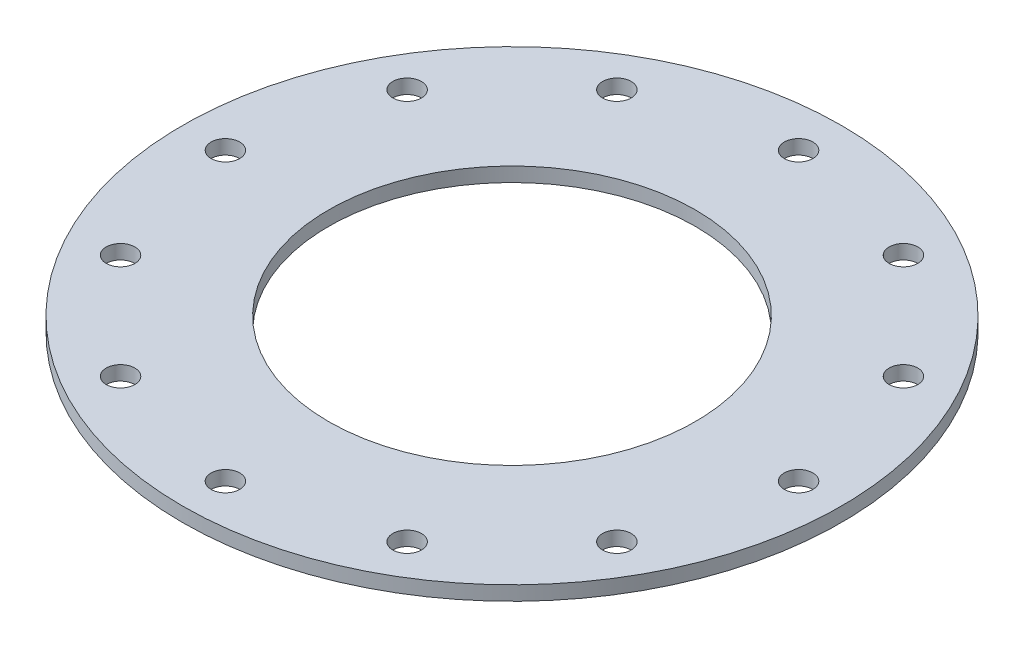
ISO-10303-21;
HEADER;
FILE_DESCRIPTION(('STEP AP214'),'2;1');
FILE_NAME('part.step','',(''),(''),'','','');
FILE_SCHEMA(('AUTOMOTIVE_DESIGN { 1 0 10303 214 1 1 1 1 }'));
ENDSEC;
DATA;
#1=APPLICATION_CONTEXT('core data for automotive mechanical design processes');
#2=APPLICATION_PROTOCOL_DEFINITION('international standard','automotive_design',2000,#1);
#3=PRODUCT_CONTEXT('',#1,'mechanical');
#4=PRODUCT('Part','Part','',(#3));
#5=PRODUCT_RELATED_PRODUCT_CATEGORY('part','',(#4));
#6=PRODUCT_DEFINITION_FORMATION('','',#4);
#7=PRODUCT_DEFINITION_CONTEXT('part definition',#1,'design');
#8=PRODUCT_DEFINITION('design','',#6,#7);
#9=PRODUCT_DEFINITION_SHAPE('','',#8);
#10=(LENGTH_UNIT() NAMED_UNIT(*) SI_UNIT(.MILLI.,.METRE.));
#11=(NAMED_UNIT(*) PLANE_ANGLE_UNIT() SI_UNIT($,.RADIAN.));
#12=(NAMED_UNIT(*) SI_UNIT($,.STERADIAN.) SOLID_ANGLE_UNIT());
#13=UNCERTAINTY_MEASURE_WITH_UNIT(LENGTH_MEASURE(1.E-05),#10,'distance_accuracy_value','');
#14=(GEOMETRIC_REPRESENTATION_CONTEXT(3) GLOBAL_UNCERTAINTY_ASSIGNED_CONTEXT((#13)) GLOBAL_UNIT_ASSIGNED_CONTEXT((#10,
#11,#12)) REPRESENTATION_CONTEXT('',''));
#15=CARTESIAN_POINT('',(0.,0.,0.));
#16=DIRECTION('',(0.,0.,1.));
#17=DIRECTION('',(1.,0.,0.));
#18=AXIS2_PLACEMENT_3D('',#15,#16,#17);
#19=CARTESIAN_POINT('',(0.,3.175,0.));
#20=DIRECTION('',(0.,-1.,0.));
#21=DIRECTION('',(0.,0.,-1.));
#22=AXIS2_PLACEMENT_3D('',#19,#20,#21);
#23=CYLINDRICAL_SURFACE('',#22,73.025);
#24=CARTESIAN_POINT('',(0.,3.175,0.));
#25=DIRECTION('',(0.,1.,0.));
#26=DIRECTION('',(0.,0.,1.));
#27=AXIS2_PLACEMENT_3D('',#24,#25,#26);
#28=CIRCLE('',#27,73.025);
#29=CARTESIAN_POINT('',(0.,3.175,73.025));
#30=VERTEX_POINT('',#29);
#31=EDGE_CURVE('E10',#30,#30,#28,.T.);
#32=ORIENTED_EDGE('',*,*,#31,.F.);
#33=EDGE_LOOP('',(#32));
#34=FACE_BOUND('',#33,.T.);
#35=CARTESIAN_POINT('',(0.,0.,0.));
#36=DIRECTION('',(0.,1.,0.));
#37=DIRECTION('',(0.,0.,1.));
#38=AXIS2_PLACEMENT_3D('',#35,#36,#37);
#39=CIRCLE('',#38,73.025);
#40=CARTESIAN_POINT('',(0.,0.,73.025));
#41=VERTEX_POINT('',#40);
#42=EDGE_CURVE('E39',#41,#41,#39,.T.);
#43=ORIENTED_EDGE('',*,*,#42,.T.);
#44=EDGE_LOOP('',(#43));
#45=FACE_BOUND('',#44,.T.);
#46=ADVANCED_FACE('F36',(#34,#45),#23,.T.);
#47=CARTESIAN_POINT('',(0.,3.175,0.));
#48=DIRECTION('',(0.,1.,0.));
#49=DIRECTION('',(0.,0.,1.));
#50=AXIS2_PLACEMENT_3D('',#47,#48,#49);
#51=PLANE('',#50);
#52=CARTESIAN_POINT('',(0.,3.175,0.));
#53=DIRECTION('',(0.,1.,0.));
#54=DIRECTION('',(0.,0.,1.));
#55=AXIS2_PLACEMENT_3D('',#52,#53,#54);
#56=CIRCLE('',#55,40.64);
#57=CARTESIAN_POINT('',(0.,3.175,40.64));
#58=VERTEX_POINT('',#57);
#59=EDGE_CURVE('E146',#58,#58,#56,.T.);
#60=ORIENTED_EDGE('',*,*,#59,.F.);
#61=EDGE_LOOP('',(#60));
#62=FACE_BOUND('',#61,.T.);
#63=CARTESIAN_POINT('',(63.5,3.175,0.));
#64=DIRECTION('',(0.,1.,0.));
#65=DIRECTION('',(0.,0.,1.));
#66=AXIS2_PLACEMENT_3D('',#63,#64,#65);
#67=CIRCLE('',#66,3.175);
#68=CARTESIAN_POINT('',(63.5,3.175,3.175));
#69=VERTEX_POINT('',#68);
#70=EDGE_CURVE('E83',#69,#69,#67,.T.);
#71=ORIENTED_EDGE('',*,*,#70,.F.);
#72=EDGE_LOOP('',(#71));
#73=FACE_BOUND('',#72,.T.);
#74=CARTESIAN_POINT('',(54.9926131403123,3.175,-31.7499999999993));
#75=DIRECTION('',(0.,1.,0.));
#76=DIRECTION('',(0.,0.,1.));
#77=AXIS2_PLACEMENT_3D('',#74,#75,#76);
#78=CIRCLE('',#77,3.17499999999999);
#79=CARTESIAN_POINT('',(54.9926131403123,3.175,-28.5749999999993));
#80=VERTEX_POINT('',#79);
#81=EDGE_CURVE('E116',#80,#80,#78,.T.);
#82=ORIENTED_EDGE('',*,*,#81,.F.);
#83=EDGE_LOOP('',(#82));
#84=FACE_BOUND('',#83,.T.);
#85=CARTESIAN_POINT('',(31.7500000000006,3.175,-54.9926131403115));
#86=DIRECTION('',(0.,1.,0.));
#87=DIRECTION('',(0.,0.,1.));
#88=AXIS2_PLACEMENT_3D('',#85,#86,#87);
#89=CIRCLE('',#88,3.175);
#90=CARTESIAN_POINT('',(31.7500000000006,3.175,-51.8176131403115));
#91=VERTEX_POINT('',#90);
#92=EDGE_CURVE('E125',#91,#91,#89,.T.);
#93=ORIENTED_EDGE('',*,*,#92,.F.);
#94=EDGE_LOOP('',(#93));
#95=FACE_BOUND('',#94,.T.);
#96=CARTESIAN_POINT('',(6.65127195049617E-13,3.175,-63.5));
#97=DIRECTION('',(0.,1.,0.));
#98=DIRECTION('',(0.,0.,1.));
#99=AXIS2_PLACEMENT_3D('',#96,#97,#98);
#100=CIRCLE('',#99,3.175);
#101=CARTESIAN_POINT('',(6.65127195049617E-13,3.175,-60.325));
#102=VERTEX_POINT('',#101);
#103=EDGE_CURVE('E133',#102,#102,#100,.T.);
#104=ORIENTED_EDGE('',*,*,#103,.F.);
#105=EDGE_LOOP('',(#104));
#106=FACE_BOUND('',#105,.T.);
#107=CARTESIAN_POINT('',(54.9926131403118,3.175,31.7500000000001));
#108=DIRECTION('',(0.,1.,0.));
#109=DIRECTION('',(0.,0.,1.));
#110=AXIS2_PLACEMENT_3D('',#107,#108,#109);
#111=CIRCLE('',#110,3.17499999999999);
#112=CARTESIAN_POINT('',(54.9926131403118,3.175,34.9250000000001));
#113=VERTEX_POINT('',#112);
#114=EDGE_CURVE('E75',#113,#113,#111,.T.);
#115=ORIENTED_EDGE('',*,*,#114,.F.);
#116=EDGE_LOOP('',(#115));
#117=FACE_BOUND('',#116,.T.);
#118=CARTESIAN_POINT('',(31.7499999999999,3.175,54.9926131403119));
#119=DIRECTION('',(0.,1.,0.));
#120=DIRECTION('',(0.,0.,1.));
#121=AXIS2_PLACEMENT_3D('',#118,#119,#120);
#122=CIRCLE('',#121,3.175);
#123=CARTESIAN_POINT('',(31.7499999999999,3.175,58.1676131403119));
#124=VERTEX_POINT('',#123);
#125=EDGE_CURVE('E67',#124,#124,#122,.T.);
#126=ORIENTED_EDGE('',*,*,#125,.F.);
#127=EDGE_LOOP('',(#126));
#128=FACE_BOUND('',#127,.T.);
#129=CARTESIAN_POINT('',(-2.21709065016539E-13,3.175,63.5));
#130=DIRECTION('',(0.,1.,0.));
#131=DIRECTION('',(0.,0.,1.));
#132=AXIS2_PLACEMENT_3D('',#129,#130,#131);
#133=CIRCLE('',#132,3.17499999999999);
#134=CARTESIAN_POINT('',(-2.21709065016539E-13,3.175,66.675));
#135=VERTEX_POINT('',#134);
#136=EDGE_CURVE('E59',#135,#135,#133,.T.);
#137=ORIENTED_EDGE('',*,*,#136,.F.);
#138=EDGE_LOOP('',(#137));
#139=FACE_BOUND('',#138,.T.);
#140=CARTESIAN_POINT('',(-31.7500000000003,3.175,54.9926131403117));
#141=DIRECTION('',(0.,1.,0.));
#142=DIRECTION('',(0.,0.,1.));
#143=AXIS2_PLACEMENT_3D('',#140,#141,#142);
#144=CIRCLE('',#143,3.175);
#145=CARTESIAN_POINT('',(-31.7500000000003,3.175,58.1676131403117));
#146=VERTEX_POINT('',#145);
#147=EDGE_CURVE('E50',#146,#146,#144,.T.);
#148=ORIENTED_EDGE('',*,*,#147,.F.);
#149=EDGE_LOOP('',(#148));
#150=FACE_BOUND('',#149,.T.);
#151=CARTESIAN_POINT('',(-54.9926131403121,3.175,31.7499999999997));
#152=DIRECTION('',(0.,1.,0.));
#153=DIRECTION('',(0.,0.,1.));
#154=AXIS2_PLACEMENT_3D('',#151,#152,#153);
#155=CIRCLE('',#154,3.175);
#156=CARTESIAN_POINT('',(-54.9926131403121,3.175,34.9249999999997));
#157=VERTEX_POINT('',#156);
#158=EDGE_CURVE('E109',#157,#157,#155,.T.);
#159=ORIENTED_EDGE('',*,*,#158,.F.);
#160=EDGE_LOOP('',(#159));
#161=FACE_BOUND('',#160,.T.);
#162=CARTESIAN_POINT('',(-63.5,3.175,-4.43418130033078E-13));
#163=DIRECTION('',(0.,1.,0.));
#164=DIRECTION('',(0.,0.,1.));
#165=AXIS2_PLACEMENT_3D('',#162,#163,#164);
#166=CIRCLE('',#165,3.17499999999999);
#167=CARTESIAN_POINT('',(-63.5,3.175,3.17499999999955));
#168=VERTEX_POINT('',#167);
#169=EDGE_CURVE('E101',#168,#168,#166,.T.);
#170=ORIENTED_EDGE('',*,*,#169,.F.);
#171=EDGE_LOOP('',(#170));
#172=FACE_BOUND('',#171,.T.);
#173=CARTESIAN_POINT('',(-54.9926131403116,3.175,-31.7500000000005));
#174=DIRECTION('',(0.,1.,0.));
#175=DIRECTION('',(0.,0.,1.));
#176=AXIS2_PLACEMENT_3D('',#173,#174,#175);
#177=CIRCLE('',#176,3.17499999999999);
#178=CARTESIAN_POINT('',(-54.9926131403116,3.175,-28.5750000000005));
#179=VERTEX_POINT('',#178);
#180=EDGE_CURVE('E93',#179,#179,#177,.T.);
#181=ORIENTED_EDGE('',*,*,#180,.F.);
#182=EDGE_LOOP('',(#181));
#183=FACE_BOUND('',#182,.T.);
#184=CARTESIAN_POINT('',(-31.7499999999995,3.175,-54.9926131403121));
#185=DIRECTION('',(0.,1.,0.));
#186=DIRECTION('',(0.,0.,1.));
#187=AXIS2_PLACEMENT_3D('',#184,#185,#186);
#188=CIRCLE('',#187,3.175);
#189=CARTESIAN_POINT('',(-31.7499999999995,3.175,-51.8176131403121));
#190=VERTEX_POINT('',#189);
#191=EDGE_CURVE('E84',#190,#190,#188,.T.);
#192=ORIENTED_EDGE('',*,*,#191,.F.);
#193=EDGE_LOOP('',(#192));
#194=FACE_BOUND('',#193,.T.);
#195=ORIENTED_EDGE('',*,*,#31,.T.);
#196=EDGE_LOOP('',(#195));
#197=FACE_BOUND('',#196,.T.);
#198=ADVANCED_FACE('F164',(#62,#73,#84,#95,#106,#117,#128,#139,#150,#161,#172,#183,#194,#197),
#51,.T.);
#199=CARTESIAN_POINT('',(0.,0.,0.));
#200=DIRECTION('',(0.,1.,0.));
#201=DIRECTION('',(0.,0.,1.));
#202=AXIS2_PLACEMENT_3D('',#199,#200,#201);
#203=PLANE('',#202);
#204=CARTESIAN_POINT('',(0.,0.,0.));
#205=DIRECTION('',(0.,1.,0.));
#206=DIRECTION('',(0.,0.,1.));
#207=AXIS2_PLACEMENT_3D('',#204,#205,#206);
#208=CIRCLE('',#207,40.64);
#209=CARTESIAN_POINT('',(0.,0.,40.64));
#210=VERTEX_POINT('',#209);
#211=EDGE_CURVE('E121',#210,#210,#208,.T.);
#212=ORIENTED_EDGE('',*,*,#211,.T.);
#213=EDGE_LOOP('',(#212));
#214=FACE_BOUND('',#213,.T.);
#215=CARTESIAN_POINT('',(63.5,0.,0.));
#216=DIRECTION('',(0.,1.,0.));
#217=DIRECTION('',(0.,0.,1.));
#218=AXIS2_PLACEMENT_3D('',#215,#216,#217);
#219=CIRCLE('',#218,3.175);
#220=CARTESIAN_POINT('',(63.5,0.,3.175));
#221=VERTEX_POINT('',#220);
#222=EDGE_CURVE('E48',#221,#221,#219,.T.);
#223=ORIENTED_EDGE('',*,*,#222,.T.);
#224=EDGE_LOOP('',(#223));
#225=FACE_BOUND('',#224,.T.);
#226=CARTESIAN_POINT('',(54.9926131403123,0.,-31.7499999999993));
#227=DIRECTION('',(0.,1.,0.));
#228=DIRECTION('',(0.,0.,1.));
#229=AXIS2_PLACEMENT_3D('',#226,#227,#228);
#230=CIRCLE('',#229,3.17499999999999);
#231=CARTESIAN_POINT('',(54.9926131403123,0.,-28.5749999999993));
#232=VERTEX_POINT('',#231);
#233=EDGE_CURVE('E120',#232,#232,#230,.T.);
#234=ORIENTED_EDGE('',*,*,#233,.T.);
#235=EDGE_LOOP('',(#234));
#236=FACE_BOUND('',#235,.T.);
#237=CARTESIAN_POINT('',(31.7500000000006,0.,-54.9926131403115));
#238=DIRECTION('',(0.,1.,0.));
#239=DIRECTION('',(0.,0.,1.));
#240=AXIS2_PLACEMENT_3D('',#237,#238,#239);
#241=CIRCLE('',#240,3.175);
#242=CARTESIAN_POINT('',(31.7500000000006,0.,-51.8176131403115));
#243=VERTEX_POINT('',#242);
#244=EDGE_CURVE('E129',#243,#243,#241,.T.);
#245=ORIENTED_EDGE('',*,*,#244,.T.);
#246=EDGE_LOOP('',(#245));
#247=FACE_BOUND('',#246,.T.);
#248=CARTESIAN_POINT('',(6.65127195049617E-13,0.,-63.5));
#249=DIRECTION('',(0.,1.,0.));
#250=DIRECTION('',(0.,0.,1.));
#251=AXIS2_PLACEMENT_3D('',#248,#249,#250);
#252=CIRCLE('',#251,3.175);
#253=CARTESIAN_POINT('',(6.65127195049617E-13,0.,-60.325));
#254=VERTEX_POINT('',#253);
#255=EDGE_CURVE('E89',#254,#254,#252,.T.);
#256=ORIENTED_EDGE('',*,*,#255,.T.);
#257=EDGE_LOOP('',(#256));
#258=FACE_BOUND('',#257,.T.);
#259=CARTESIAN_POINT('',(54.9926131403118,0.,31.7500000000001));
#260=DIRECTION('',(0.,1.,0.));
#261=DIRECTION('',(0.,0.,1.));
#262=AXIS2_PLACEMENT_3D('',#259,#260,#261);
#263=CIRCLE('',#262,3.17499999999999);
#264=CARTESIAN_POINT('',(54.9926131403118,0.,34.9250000000001));
#265=VERTEX_POINT('',#264);
#266=EDGE_CURVE('E79',#265,#265,#263,.T.);
#267=ORIENTED_EDGE('',*,*,#266,.T.);
#268=EDGE_LOOP('',(#267));
#269=FACE_BOUND('',#268,.T.);
#270=CARTESIAN_POINT('',(31.7499999999999,0.,54.9926131403119));
#271=DIRECTION('',(0.,1.,0.));
#272=DIRECTION('',(0.,0.,1.));
#273=AXIS2_PLACEMENT_3D('',#270,#271,#272);
#274=CIRCLE('',#273,3.175);
#275=CARTESIAN_POINT('',(31.7499999999999,0.,58.1676131403119));
#276=VERTEX_POINT('',#275);
#277=EDGE_CURVE('E71',#276,#276,#274,.T.);
#278=ORIENTED_EDGE('',*,*,#277,.T.);
#279=EDGE_LOOP('',(#278));
#280=FACE_BOUND('',#279,.T.);
#281=CARTESIAN_POINT('',(-2.21709065016539E-13,0.,63.5));
#282=DIRECTION('',(0.,1.,0.));
#283=DIRECTION('',(0.,0.,1.));
#284=AXIS2_PLACEMENT_3D('',#281,#282,#283);
#285=CIRCLE('',#284,3.17499999999999);
#286=CARTESIAN_POINT('',(-2.21709065016539E-13,0.,66.675));
#287=VERTEX_POINT('',#286);
#288=EDGE_CURVE('E63',#287,#287,#285,.T.);
#289=ORIENTED_EDGE('',*,*,#288,.T.);
#290=EDGE_LOOP('',(#289));
#291=FACE_BOUND('',#290,.T.);
#292=CARTESIAN_POINT('',(-31.7500000000003,0.,54.9926131403117));
#293=DIRECTION('',(0.,1.,0.));
#294=DIRECTION('',(0.,0.,1.));
#295=AXIS2_PLACEMENT_3D('',#292,#293,#294);
#296=CIRCLE('',#295,3.175);
#297=CARTESIAN_POINT('',(-31.7500000000003,0.,58.1676131403117));
#298=VERTEX_POINT('',#297);
#299=EDGE_CURVE('E54',#298,#298,#296,.T.);
#300=ORIENTED_EDGE('',*,*,#299,.T.);
#301=EDGE_LOOP('',(#300));
#302=FACE_BOUND('',#301,.T.);
#303=CARTESIAN_POINT('',(-54.9926131403121,0.,31.7499999999997));
#304=DIRECTION('',(0.,1.,0.));
#305=DIRECTION('',(0.,0.,1.));
#306=AXIS2_PLACEMENT_3D('',#303,#304,#305);
#307=CIRCLE('',#306,3.175);
#308=CARTESIAN_POINT('',(-54.9926131403121,0.,34.9249999999997));
#309=VERTEX_POINT('',#308);
#310=EDGE_CURVE('E55',#309,#309,#307,.T.);
#311=ORIENTED_EDGE('',*,*,#310,.T.);
#312=EDGE_LOOP('',(#311));
#313=FACE_BOUND('',#312,.T.);
#314=CARTESIAN_POINT('',(-63.5,0.,-4.43418130033078E-13));
#315=DIRECTION('',(0.,1.,0.));
#316=DIRECTION('',(0.,0.,1.));
#317=AXIS2_PLACEMENT_3D('',#314,#315,#316);
#318=CIRCLE('',#317,3.17499999999999);
#319=CARTESIAN_POINT('',(-63.5,0.,3.17499999999955));
#320=VERTEX_POINT('',#319);
#321=EDGE_CURVE('E105',#320,#320,#318,.T.);
#322=ORIENTED_EDGE('',*,*,#321,.T.);
#323=EDGE_LOOP('',(#322));
#324=FACE_BOUND('',#323,.T.);
#325=CARTESIAN_POINT('',(-54.9926131403116,0.,-31.7500000000005));
#326=DIRECTION('',(0.,1.,0.));
#327=DIRECTION('',(0.,0.,1.));
#328=AXIS2_PLACEMENT_3D('',#325,#326,#327);
#329=CIRCLE('',#328,3.17499999999999);
#330=CARTESIAN_POINT('',(-54.9926131403116,0.,-28.5750000000005));
#331=VERTEX_POINT('',#330);
#332=EDGE_CURVE('E97',#331,#331,#329,.T.);
#333=ORIENTED_EDGE('',*,*,#332,.T.);
#334=EDGE_LOOP('',(#333));
#335=FACE_BOUND('',#334,.T.);
#336=CARTESIAN_POINT('',(-31.7499999999995,0.,-54.9926131403121));
#337=DIRECTION('',(0.,1.,0.));
#338=DIRECTION('',(0.,0.,1.));
#339=AXIS2_PLACEMENT_3D('',#336,#337,#338);
#340=CIRCLE('',#339,3.175);
#341=CARTESIAN_POINT('',(-31.7499999999995,0.,-51.8176131403121));
#342=VERTEX_POINT('',#341);
#343=EDGE_CURVE('E88',#342,#342,#340,.T.);
#344=ORIENTED_EDGE('',*,*,#343,.T.);
#345=EDGE_LOOP('',(#344));
#346=FACE_BOUND('',#345,.T.);
#347=ORIENTED_EDGE('',*,*,#42,.F.);
#348=EDGE_LOOP('',(#347));
#349=FACE_BOUND('',#348,.T.);
#350=ADVANCED_FACE('F154',(#214,#225,#236,#247,#258,#269,#280,#291,#302,#313,#324,#335,#346,
#349),#203,.F.);
#351=CARTESIAN_POINT('',(-31.7499999999995,0.,-54.9926131403121));
#352=DIRECTION('',(0.,1.,0.));
#353=DIRECTION('',(0.,0.,1.));
#354=AXIS2_PLACEMENT_3D('',#351,#352,#353);
#355=CYLINDRICAL_SURFACE('',#354,3.175);
#356=ORIENTED_EDGE('',*,*,#343,.F.);
#357=EDGE_LOOP('',(#356));
#358=FACE_BOUND('',#357,.T.);
#359=ORIENTED_EDGE('',*,*,#191,.T.);
#360=EDGE_LOOP('',(#359));
#361=FACE_BOUND('',#360,.T.);
#362=ADVANCED_FACE('F192',(#358,#361),#355,.F.);
#363=CARTESIAN_POINT('',(-54.9926131403116,0.,-31.7500000000005));
#364=DIRECTION('',(0.,1.,0.));
#365=DIRECTION('',(0.,0.,1.));
#366=AXIS2_PLACEMENT_3D('',#363,#364,#365);
#367=CYLINDRICAL_SURFACE('',#366,3.17499999999999);
#368=ORIENTED_EDGE('',*,*,#332,.F.);
#369=EDGE_LOOP('',(#368));
#370=FACE_BOUND('',#369,.T.);
#371=ORIENTED_EDGE('',*,*,#180,.T.);
#372=EDGE_LOOP('',(#371));
#373=FACE_BOUND('',#372,.T.);
#374=ADVANCED_FACE('F194',(#370,#373),#367,.F.);
#375=CARTESIAN_POINT('',(-63.5,0.,-4.43418130033078E-13));
#376=DIRECTION('',(0.,1.,0.));
#377=DIRECTION('',(0.,0.,1.));
#378=AXIS2_PLACEMENT_3D('',#375,#376,#377);
#379=CYLINDRICAL_SURFACE('',#378,3.17499999999999);
#380=ORIENTED_EDGE('',*,*,#321,.F.);
#381=EDGE_LOOP('',(#380));
#382=FACE_BOUND('',#381,.T.);
#383=ORIENTED_EDGE('',*,*,#169,.T.);
#384=EDGE_LOOP('',(#383));
#385=FACE_BOUND('',#384,.T.);
#386=ADVANCED_FACE('F201',(#382,#385),#379,.F.);
#387=CARTESIAN_POINT('',(-54.9926131403121,0.,31.7499999999997));
#388=DIRECTION('',(0.,1.,0.));
#389=DIRECTION('',(0.,0.,1.));
#390=AXIS2_PLACEMENT_3D('',#387,#388,#389);
#391=CYLINDRICAL_SURFACE('',#390,3.175);
#392=ORIENTED_EDGE('',*,*,#310,.F.);
#393=EDGE_LOOP('',(#392));
#394=FACE_BOUND('',#393,.T.);
#395=ORIENTED_EDGE('',*,*,#158,.T.);
#396=EDGE_LOOP('',(#395));
#397=FACE_BOUND('',#396,.T.);
#398=ADVANCED_FACE('F293',(#394,#397),#391,.F.);
#399=CARTESIAN_POINT('',(-31.7500000000003,0.,54.9926131403117));
#400=DIRECTION('',(0.,1.,0.));
#401=DIRECTION('',(0.,0.,1.));
#402=AXIS2_PLACEMENT_3D('',#399,#400,#401);
#403=CYLINDRICAL_SURFACE('',#402,3.175);
#404=ORIENTED_EDGE('',*,*,#299,.F.);
#405=EDGE_LOOP('',(#404));
#406=FACE_BOUND('',#405,.T.);
#407=ORIENTED_EDGE('',*,*,#147,.T.);
#408=EDGE_LOOP('',(#407));
#409=FACE_BOUND('',#408,.T.);
#410=ADVANCED_FACE('F285',(#406,#409),#403,.F.);
#411=CARTESIAN_POINT('',(-2.21709065016539E-13,0.,63.5));
#412=DIRECTION('',(0.,1.,0.));
#413=DIRECTION('',(0.,0.,1.));
#414=AXIS2_PLACEMENT_3D('',#411,#412,#413);
#415=CYLINDRICAL_SURFACE('',#414,3.17499999999999);
#416=ORIENTED_EDGE('',*,*,#288,.F.);
#417=EDGE_LOOP('',(#416));
#418=FACE_BOUND('',#417,.T.);
#419=ORIENTED_EDGE('',*,*,#136,.T.);
#420=EDGE_LOOP('',(#419));
#421=FACE_BOUND('',#420,.T.);
#422=ADVANCED_FACE('F277',(#418,#421),#415,.F.);
#423=CARTESIAN_POINT('',(31.7499999999999,0.,54.9926131403119));
#424=DIRECTION('',(0.,1.,0.));
#425=DIRECTION('',(0.,0.,1.));
#426=AXIS2_PLACEMENT_3D('',#423,#424,#425);
#427=CYLINDRICAL_SURFACE('',#426,3.175);
#428=ORIENTED_EDGE('',*,*,#277,.F.);
#429=EDGE_LOOP('',(#428));
#430=FACE_BOUND('',#429,.T.);
#431=ORIENTED_EDGE('',*,*,#125,.T.);
#432=EDGE_LOOP('',(#431));
#433=FACE_BOUND('',#432,.T.);
#434=ADVANCED_FACE('F270',(#430,#433),#427,.F.);
#435=CARTESIAN_POINT('',(54.9926131403118,0.,31.7500000000001));
#436=DIRECTION('',(0.,1.,0.));
#437=DIRECTION('',(0.,0.,1.));
#438=AXIS2_PLACEMENT_3D('',#435,#436,#437);
#439=CYLINDRICAL_SURFACE('',#438,3.17499999999999);
#440=ORIENTED_EDGE('',*,*,#266,.F.);
#441=EDGE_LOOP('',(#440));
#442=FACE_BOUND('',#441,.T.);
#443=ORIENTED_EDGE('',*,*,#114,.T.);
#444=EDGE_LOOP('',(#443));
#445=FACE_BOUND('',#444,.T.);
#446=ADVANCED_FACE('F262',(#442,#445),#439,.F.);
#447=CARTESIAN_POINT('',(6.65127195049617E-13,0.,-63.5));
#448=DIRECTION('',(0.,1.,0.));
#449=DIRECTION('',(0.,0.,1.));
#450=AXIS2_PLACEMENT_3D('',#447,#448,#449);
#451=CYLINDRICAL_SURFACE('',#450,3.175);
#452=ORIENTED_EDGE('',*,*,#255,.F.);
#453=EDGE_LOOP('',(#452));
#454=FACE_BOUND('',#453,.T.);
#455=ORIENTED_EDGE('',*,*,#103,.T.);
#456=EDGE_LOOP('',(#455));
#457=FACE_BOUND('',#456,.T.);
#458=ADVANCED_FACE('F254',(#454,#457),#451,.F.);
#459=CARTESIAN_POINT('',(31.7500000000006,0.,-54.9926131403115));
#460=DIRECTION('',(0.,1.,0.));
#461=DIRECTION('',(0.,0.,1.));
#462=AXIS2_PLACEMENT_3D('',#459,#460,#461);
#463=CYLINDRICAL_SURFACE('',#462,3.175);
#464=ORIENTED_EDGE('',*,*,#244,.F.);
#465=EDGE_LOOP('',(#464));
#466=FACE_BOUND('',#465,.T.);
#467=ORIENTED_EDGE('',*,*,#92,.T.);
#468=EDGE_LOOP('',(#467));
#469=FACE_BOUND('',#468,.T.);
#470=ADVANCED_FACE('F246',(#466,#469),#463,.F.);
#471=CARTESIAN_POINT('',(54.9926131403123,0.,-31.7499999999993));
#472=DIRECTION('',(0.,1.,0.));
#473=DIRECTION('',(0.,0.,1.));
#474=AXIS2_PLACEMENT_3D('',#471,#472,#473);
#475=CYLINDRICAL_SURFACE('',#474,3.17499999999999);
#476=ORIENTED_EDGE('',*,*,#233,.F.);
#477=EDGE_LOOP('',(#476));
#478=FACE_BOUND('',#477,.T.);
#479=ORIENTED_EDGE('',*,*,#81,.T.);
#480=EDGE_LOOP('',(#479));
#481=FACE_BOUND('',#480,.T.);
#482=ADVANCED_FACE('F239',(#478,#481),#475,.F.);
#483=CARTESIAN_POINT('',(63.5,0.,0.));
#484=DIRECTION('',(0.,1.,0.));
#485=DIRECTION('',(0.,0.,1.));
#486=AXIS2_PLACEMENT_3D('',#483,#484,#485);
#487=CYLINDRICAL_SURFACE('',#486,3.175);
#488=ORIENTED_EDGE('',*,*,#222,.F.);
#489=EDGE_LOOP('',(#488));
#490=FACE_BOUND('',#489,.T.);
#491=ORIENTED_EDGE('',*,*,#70,.T.);
#492=EDGE_LOOP('',(#491));
#493=FACE_BOUND('',#492,.T.);
#494=ADVANCED_FACE('F160',(#490,#493),#487,.F.);
#495=CARTESIAN_POINT('',(0.,0.,0.));
#496=DIRECTION('',(0.,1.,0.));
#497=DIRECTION('',(0.,0.,1.));
#498=AXIS2_PLACEMENT_3D('',#495,#496,#497);
#499=CYLINDRICAL_SURFACE('',#498,40.64);
#500=ORIENTED_EDGE('',*,*,#211,.F.);
#501=EDGE_LOOP('',(#500));
#502=FACE_BOUND('',#501,.T.);
#503=ORIENTED_EDGE('',*,*,#59,.T.);
#504=EDGE_LOOP('',(#503));
#505=FACE_BOUND('',#504,.T.);
#506=ADVANCED_FACE('F157',(#502,#505),#499,.F.);
#507=CLOSED_SHELL('',(#46,#198,#350,#362,#374,#386,#398,#410,#422,#434,#446,#458,#470,#482,#494,#506));
#508=MANIFOLD_SOLID_BREP('B2',#507);
#509=ADVANCED_BREP_SHAPE_REPRESENTATION('',(#18,#508),#14);
#510=SHAPE_DEFINITION_REPRESENTATION(#9,#509);
ENDSEC;
END-ISO-10303-21;
